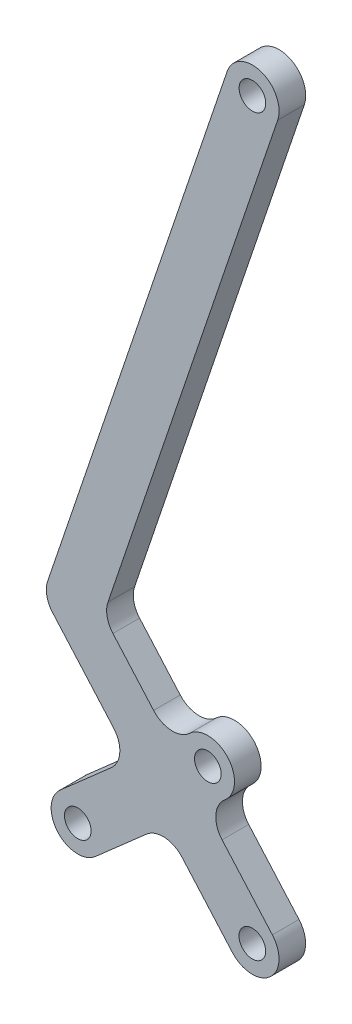
ISO-10303-21;
HEADER;
FILE_DESCRIPTION(('STEP AP214'),'2;1');
FILE_NAME('part.step','',(''),(''),'','','');
FILE_SCHEMA(('AUTOMOTIVE_DESIGN { 1 0 10303 214 1 1 1 1 }'));
ENDSEC;
DATA;
#1=APPLICATION_CONTEXT('core data for automotive mechanical design processes');
#2=APPLICATION_PROTOCOL_DEFINITION('international standard','automotive_design',2000,#1);
#3=PRODUCT_CONTEXT('',#1,'mechanical');
#4=PRODUCT('Part','Part','',(#3));
#5=PRODUCT_RELATED_PRODUCT_CATEGORY('part','',(#4));
#6=PRODUCT_DEFINITION_FORMATION('','',#4);
#7=PRODUCT_DEFINITION_CONTEXT('part definition',#1,'design');
#8=PRODUCT_DEFINITION('design','',#6,#7);
#9=PRODUCT_DEFINITION_SHAPE('','',#8);
#10=(LENGTH_UNIT() NAMED_UNIT(*) SI_UNIT(.MILLI.,.METRE.));
#11=(NAMED_UNIT(*) PLANE_ANGLE_UNIT() SI_UNIT($,.RADIAN.));
#12=(NAMED_UNIT(*) SI_UNIT($,.STERADIAN.) SOLID_ANGLE_UNIT());
#13=UNCERTAINTY_MEASURE_WITH_UNIT(LENGTH_MEASURE(1.E-05),#10,'distance_accuracy_value','');
#14=(GEOMETRIC_REPRESENTATION_CONTEXT(3) GLOBAL_UNCERTAINTY_ASSIGNED_CONTEXT((#13)) GLOBAL_UNIT_ASSIGNED_CONTEXT((#10,
#11,#12)) REPRESENTATION_CONTEXT('',''));
#15=CARTESIAN_POINT('',(0.,0.,0.));
#16=DIRECTION('',(0.,0.,1.));
#17=DIRECTION('',(1.,0.,0.));
#18=AXIS2_PLACEMENT_3D('',#15,#16,#17);
#19=CARTESIAN_POINT('',(0.,0.,12.7));
#20=DIRECTION('',(0.,0.,1.));
#21=DIRECTION('',(1.,0.,0.));
#22=AXIS2_PLACEMENT_3D('',#19,#20,#21);
#23=PLANE('',#22);
#24=CARTESIAN_POINT('',(-0.0424209515311639,-349.999997429233,12.7));
#25=DIRECTION('',(0.,0.,1.));
#26=DIRECTION('',(1.,0.,0.));
#27=AXIS2_PLACEMENT_3D('',#24,#25,#26);
#28=CIRCLE('',#27,6.34999999999992);
#29=CARTESIAN_POINT('',(6.30757904846875,-349.999997429233,12.7));
#30=VERTEX_POINT('',#29);
#31=EDGE_CURVE('E396',#30,#30,#28,.T.);
#32=ORIENTED_EDGE('',*,*,#31,.F.);
#33=EDGE_LOOP('',(#32));
#34=FACE_BOUND('',#33,.T.);
#35=CARTESIAN_POINT('',(-21.2523638635323,-287.419662485501,12.7));
#36=DIRECTION('',(0.,0.,1.));
#37=DIRECTION('',(1.,0.,0.));
#38=AXIS2_PLACEMENT_3D('',#35,#36,#37);
#39=CIRCLE('',#38,6.35);
#40=CARTESIAN_POINT('',(-14.9023638635323,-287.419662485501,12.7));
#41=VERTEX_POINT('',#40);
#42=EDGE_CURVE('E206',#41,#41,#39,.T.);
#43=ORIENTED_EDGE('',*,*,#42,.F.);
#44=EDGE_LOOP('',(#43));
#45=FACE_BOUND('',#44,.T.);
#46=CARTESIAN_POINT('',(0.,0.,12.7));
#47=DIRECTION('',(0.,0.,1.));
#48=DIRECTION('',(1.,0.,0.));
#49=AXIS2_PLACEMENT_3D('',#46,#47,#48);
#50=CIRCLE('',#49,12.7);
#51=CARTESIAN_POINT('',(12.0316476147068,-4.06564332861642,12.7));
#52=VERTEX_POINT('',#51);
#53=CARTESIAN_POINT('',(-12.0316476147067,4.06564332861641,12.7));
#54=VERTEX_POINT('',#53);
#55=EDGE_CURVE('E241',#52,#54,#50,.T.);
#56=ORIENTED_EDGE('',*,*,#55,.T.);
#57=DIRECTION('',(-0.320129395954047,-0.94737382792966,0.));
#58=VECTOR('',#57,1.);
#59=CARTESIAN_POINT('',(-12.0316476147067,4.06564332861641,12.7));
#60=LINE('',#59,#58);
#61=CARTESIAN_POINT('',(-97.6126036681888,-249.198064906118,12.7));
#62=VERTEX_POINT('',#61);
#63=EDGE_CURVE('E129',#54,#62,#60,.T.);
#64=ORIENTED_EDGE('',*,*,#63,.T.);
#65=CARTESIAN_POINT('',(-86.2441177330329,-253.039617657566,12.7));
#66=DIRECTION('',(0.,0.,1.));
#67=DIRECTION('',(1.,0.,0.));
#68=AXIS2_PLACEMENT_3D('',#65,#66,#67);
#69=CIRCLE('',#68,12.);
#70=CARTESIAN_POINT('',(-95.2552429733433,-260.964238904253,12.7));
#71=VERTEX_POINT('',#70);
#72=EDGE_CURVE('E292',#62,#71,#69,.T.);
#73=ORIENTED_EDGE('',*,*,#72,.T.);
#74=DIRECTION('',(0.660385103890572,-0.7509271033592,0.));
#75=VECTOR('',#74,1.);
#76=CARTESIAN_POINT('',(-95.2552429733433,-260.964238904253,12.7));
#77=LINE('',#76,#75);
#78=CARTESIAN_POINT('',(-66.1741985676148,-294.03243549076,12.7));
#79=VERTEX_POINT('',#78);
#80=EDGE_CURVE('E311',#71,#79,#77,.T.);
#81=ORIENTED_EDGE('',*,*,#80,.T.);
#82=CARTESIAN_POINT('',(-75.1853238079252,-301.957056737447,12.7));
#83=DIRECTION('',(0.,0.,-1.));
#84=DIRECTION('',(1.,0.,0.));
#85=AXIS2_PLACEMENT_3D('',#82,#83,#84);
#86=CIRCLE('',#85,12.);
#87=CARTESIAN_POINT('',(-67.2607025612384,-310.968181977757,12.7));
#88=VERTEX_POINT('',#87);
#89=EDGE_CURVE('E308',#79,#88,#86,.T.);
#90=ORIENTED_EDGE('',*,*,#89,.T.);
#91=DIRECTION('',(-0.750927103359199,-0.660385103890573,0.));
#92=VECTOR('',#91,1.);
#93=CARTESIAN_POINT('',(-67.2607025612384,-310.968181977757,12.7));
#94=LINE('',#93,#92);
#95=CARTESIAN_POINT('',(-91.6282870652444,-332.397678599006,12.7));
#96=VERTEX_POINT('',#95);
#97=EDGE_CURVE('E310',#88,#96,#94,.T.);
#98=ORIENTED_EDGE('',*,*,#97,.T.);
#99=CARTESIAN_POINT('',(-83.2413962458342,-341.934452811668,12.7));
#100=DIRECTION('',(0.,0.,1.));
#101=DIRECTION('',(1.,0.,0.));
#102=AXIS2_PLACEMENT_3D('',#99,#100,#101);
#103=CIRCLE('',#102,12.6999999999998);
#104=CARTESIAN_POINT('',(-74.8545054264241,-351.471227024329,12.7));
#105=VERTEX_POINT('',#104);
#106=EDGE_CURVE('E313',#96,#105,#103,.T.);
#107=ORIENTED_EDGE('',*,*,#106,.T.);
#108=DIRECTION('',(0.750927103359201,0.660385103890571,0.));
#109=VECTOR('',#108,1.);
#110=CARTESIAN_POINT('',(-50.4869209224181,-330.04173040308,12.7));
#111=LINE('',#110,#109);
#112=CARTESIAN_POINT('',(-50.4869209224181,-330.04173040308,12.7));
#113=VERTEX_POINT('',#112);
#114=EDGE_CURVE('E319',#105,#113,#111,.T.);
#115=ORIENTED_EDGE('',*,*,#114,.T.);
#116=CARTESIAN_POINT('',(-42.5622996757312,-339.052855643391,12.7));
#117=DIRECTION('',(0.,0.,-1.));
#118=DIRECTION('',(1.,0.,0.));
#119=AXIS2_PLACEMENT_3D('',#116,#117,#118);
#120=CIRCLE('',#119,12.);
#121=CARTESIAN_POINT('',(-33.5511744354208,-331.128234396704,12.7));
#122=VERTEX_POINT('',#121);
#123=EDGE_CURVE('E321',#113,#122,#120,.T.);
#124=ORIENTED_EDGE('',*,*,#123,.T.);
#125=DIRECTION('',(0.660385103890571,-0.7509271033592,0.));
#126=VECTOR('',#125,1.);
#127=CARTESIAN_POINT('',(-33.5511744354208,-331.128234396704,12.7));
#128=LINE('',#127,#126);
#129=CARTESIAN_POINT('',(-9.57919516419298,-358.386888248643,12.7));
#130=VERTEX_POINT('',#129);
#131=EDGE_CURVE('E323',#122,#130,#128,.T.);
#132=ORIENTED_EDGE('',*,*,#131,.T.);
#133=CARTESIAN_POINT('',(-0.0424209515311639,-349.999997429233,12.7));
#134=DIRECTION('',(0.,0.,1.));
#135=DIRECTION('',(1.,0.,0.));
#136=AXIS2_PLACEMENT_3D('',#133,#134,#135);
#137=CIRCLE('',#136,12.7);
#138=CARTESIAN_POINT('',(9.49435326113062,-341.613106609822,12.7));
#139=VERTEX_POINT('',#138);
#140=EDGE_CURVE('E325',#130,#139,#137,.T.);
#141=ORIENTED_EDGE('',*,*,#140,.T.);
#142=DIRECTION('',(-0.660385103890569,0.750927103359202,0.));
#143=VECTOR('',#142,1.);
#144=CARTESIAN_POINT('',(9.4943532611306,-341.613106609822,12.7));
#145=LINE('',#144,#143);
#146=CARTESIAN_POINT('',(-14.477626010097,-314.354452757884,12.7));
#147=VERTEX_POINT('',#146);
#148=EDGE_CURVE('E327',#139,#147,#145,.T.);
#149=ORIENTED_EDGE('',*,*,#148,.T.);
#150=CARTESIAN_POINT('',(-5.46650076978666,-306.429831511197,12.7));
#151=DIRECTION('',(0.,0.,-1.));
#152=DIRECTION('',(-1.,0.,0.));
#153=AXIS2_PLACEMENT_3D('',#150,#151,#152);
#154=CIRCLE('',#153,11.9999999999999);
#155=CARTESIAN_POINT('',(-13.3911220164734,-297.418706270886,12.7));
#156=VERTEX_POINT('',#155);
#157=EDGE_CURVE('E329',#147,#156,#154,.T.);
#158=ORIENTED_EDGE('',*,*,#157,.T.);
#159=DIRECTION('',(0.750927103359165,0.660385103890611,0.));
#160=VECTOR('',#159,1.);
#161=CARTESIAN_POINT('',(-13.3911220164734,-297.418706270886,12.7));
#162=LINE('',#161,#160);
#163=CARTESIAN_POINT('',(-12.8654730441222,-296.956436698163,12.7));
#164=VERTEX_POINT('',#163);
#165=EDGE_CURVE('E331',#156,#164,#162,.T.);
#166=ORIENTED_EDGE('',*,*,#165,.T.);
#167=CARTESIAN_POINT('',(-21.2523638635323,-287.419662485501,12.7));
#168=DIRECTION('',(0.,0.,1.));
#169=DIRECTION('',(-1.,0.,0.));
#170=AXIS2_PLACEMENT_3D('',#167,#168,#169);
#171=CIRCLE('',#170,12.7);
#172=CARTESIAN_POINT('',(-29.6392546829426,-277.882888272839,12.7));
#173=VERTEX_POINT('',#172);
#174=EDGE_CURVE('E333',#164,#173,#171,.T.);
#175=ORIENTED_EDGE('',*,*,#174,.T.);
#176=DIRECTION('',(-0.75092710335927,-0.660385103890492,0.));
#177=VECTOR('',#176,1.);
#178=CARTESIAN_POINT('',(-30.164903655294,-278.345157845563,12.7));
#179=LINE('',#178,#177);
#180=CARTESIAN_POINT('',(-30.164903655294,-278.345157845563,12.7));
#181=VERTEX_POINT('',#180);
#182=EDGE_CURVE('E335',#173,#181,#179,.T.);
#183=ORIENTED_EDGE('',*,*,#182,.T.);
#184=CARTESIAN_POINT('',(-38.0895249019807,-269.334032605252,12.7));
#185=DIRECTION('',(0.,0.,-1.));
#186=DIRECTION('',(-1.,0.,0.));
#187=AXIS2_PLACEMENT_3D('',#184,#185,#186);
#188=CIRCLE('',#187,11.9999999999999);
#189=CARTESIAN_POINT('',(-47.1006501422912,-277.258653851939,12.7));
#190=VERTEX_POINT('',#189);
#191=EDGE_CURVE('E184',#181,#190,#188,.T.);
#192=ORIENTED_EDGE('',*,*,#191,.T.);
#193=DIRECTION('',(-0.660385103890571,0.750927103359201,0.));
#194=VECTOR('',#193,1.);
#195=CARTESIAN_POINT('',(-47.1006501422913,-277.258653851939,12.7));
#196=LINE('',#195,#194);
#197=CARTESIAN_POINT('',(-66.4973472035185,-255.202575583195,12.7));
#198=VERTEX_POINT('',#197);
#199=EDGE_CURVE('E178',#190,#198,#196,.T.);
#200=ORIENTED_EDGE('',*,*,#199,.T.);
#201=CARTESIAN_POINT('',(-57.4862219632082,-247.277954336508,12.7));
#202=DIRECTION('',(0.,0.,-1.));
#203=DIRECTION('',(-1.,0.,0.));
#204=AXIS2_PLACEMENT_3D('',#201,#202,#203);
#205=CIRCLE('',#204,12.);
#206=CARTESIAN_POINT('',(-68.8547078983641,-243.436401585059,12.7));
#207=VERTEX_POINT('',#206);
#208=EDGE_CURVE('E182',#198,#207,#205,.T.);
#209=ORIENTED_EDGE('',*,*,#208,.T.);
#210=DIRECTION('',(0.320129395954047,0.94737382792966,0.));
#211=VECTOR('',#210,1.);
#212=CARTESIAN_POINT('',(-68.8547078983641,-243.436401585059,12.7));
#213=LINE('',#212,#211);
#214=EDGE_CURVE('E50',#207,#52,#213,.T.);
#215=ORIENTED_EDGE('',*,*,#214,.T.);
#216=EDGE_LOOP('',(#56,#64,#73,#81,#90,#98,#107,#115,#124,#132,#141,#149,#158,#166,#175,#183,
#192,#200,#209,#215));
#217=FACE_BOUND('',#216,.T.);
#218=CARTESIAN_POINT('',(-83.2413962458342,-341.934452811668,12.7));
#219=DIRECTION('',(0.,0.,1.));
#220=DIRECTION('',(1.,0.,0.));
#221=AXIS2_PLACEMENT_3D('',#218,#219,#220);
#222=CIRCLE('',#221,6.34999999999999);
#223=CARTESIAN_POINT('',(-76.8913962458342,-341.934452811668,12.7));
#224=VERTEX_POINT('',#223);
#225=EDGE_CURVE('E402',#224,#224,#222,.T.);
#226=ORIENTED_EDGE('',*,*,#225,.F.);
#227=EDGE_LOOP('',(#226));
#228=FACE_BOUND('',#227,.T.);
#229=CARTESIAN_POINT('',(0.,0.,12.7));
#230=DIRECTION('',(0.,0.,1.));
#231=DIRECTION('',(1.,0.,0.));
#232=AXIS2_PLACEMENT_3D('',#229,#230,#231);
#233=CIRCLE('',#232,6.35);
#234=CARTESIAN_POINT('',(6.35000000000003,0.,12.7));
#235=VERTEX_POINT('',#234);
#236=EDGE_CURVE('E387',#235,#235,#233,.T.);
#237=ORIENTED_EDGE('',*,*,#236,.F.);
#238=EDGE_LOOP('',(#237));
#239=FACE_BOUND('',#238,.T.);
#240=ADVANCED_FACE('F33',(#34,#45,#217,#228,#239),#23,.T.);
#241=CARTESIAN_POINT('',(0.,0.,0.));
#242=DIRECTION('',(0.,0.,1.));
#243=DIRECTION('',(1.,0.,0.));
#244=AXIS2_PLACEMENT_3D('',#241,#242,#243);
#245=PLANE('',#244);
#246=CARTESIAN_POINT('',(-0.0424209515311639,-349.999997429233,0.));
#247=DIRECTION('',(0.,0.,1.));
#248=DIRECTION('',(1.,0.,0.));
#249=AXIS2_PLACEMENT_3D('',#246,#247,#248);
#250=CIRCLE('',#249,6.34999999999992);
#251=CARTESIAN_POINT('',(6.30757904846875,-349.999997429233,0.));
#252=VERTEX_POINT('',#251);
#253=EDGE_CURVE('E393',#252,#252,#250,.T.);
#254=ORIENTED_EDGE('',*,*,#253,.T.);
#255=EDGE_LOOP('',(#254));
#256=FACE_BOUND('',#255,.T.);
#257=CARTESIAN_POINT('',(-21.2523638635323,-287.419662485501,0.));
#258=DIRECTION('',(0.,0.,1.));
#259=DIRECTION('',(1.,0.,0.));
#260=AXIS2_PLACEMENT_3D('',#257,#258,#259);
#261=CIRCLE('',#260,6.35);
#262=CARTESIAN_POINT('',(-14.9023638635323,-287.419662485501,0.));
#263=VERTEX_POINT('',#262);
#264=EDGE_CURVE('E405',#263,#263,#261,.T.);
#265=ORIENTED_EDGE('',*,*,#264,.T.);
#266=EDGE_LOOP('',(#265));
#267=FACE_BOUND('',#266,.T.);
#268=CARTESIAN_POINT('',(0.,0.,0.));
#269=DIRECTION('',(0.,0.,1.));
#270=DIRECTION('',(1.,0.,0.));
#271=AXIS2_PLACEMENT_3D('',#268,#269,#270);
#272=CIRCLE('',#271,12.7);
#273=CARTESIAN_POINT('',(12.0316476147068,-4.06564332861642,0.));
#274=VERTEX_POINT('',#273);
#275=CARTESIAN_POINT('',(-12.0316476147067,4.06564332861641,0.));
#276=VERTEX_POINT('',#275);
#277=EDGE_CURVE('E202',#274,#276,#272,.T.);
#278=ORIENTED_EDGE('',*,*,#277,.F.);
#279=DIRECTION('',(0.320129395954047,0.94737382792966,0.));
#280=VECTOR('',#279,1.);
#281=CARTESIAN_POINT('',(-68.8547078983641,-243.436401585059,0.));
#282=LINE('',#281,#280);
#283=CARTESIAN_POINT('',(-68.8547078983641,-243.436401585059,0.));
#284=VERTEX_POINT('',#283);
#285=EDGE_CURVE('E121',#284,#274,#282,.T.);
#286=ORIENTED_EDGE('',*,*,#285,.F.);
#287=CARTESIAN_POINT('',(-57.4862219632082,-247.277954336508,0.));
#288=DIRECTION('',(0.,0.,-1.));
#289=DIRECTION('',(-1.,0.,0.));
#290=AXIS2_PLACEMENT_3D('',#287,#288,#289);
#291=CIRCLE('',#290,12.);
#292=CARTESIAN_POINT('',(-66.4973472035185,-255.202575583195,0.));
#293=VERTEX_POINT('',#292);
#294=EDGE_CURVE('E115',#293,#284,#291,.T.);
#295=ORIENTED_EDGE('',*,*,#294,.F.);
#296=DIRECTION('',(-0.660385103890571,0.750927103359201,0.));
#297=VECTOR('',#296,1.);
#298=CARTESIAN_POINT('',(-47.1006501422913,-277.258653851939,0.));
#299=LINE('',#298,#297);
#300=CARTESIAN_POINT('',(-47.1006501422912,-277.258653851939,0.));
#301=VERTEX_POINT('',#300);
#302=EDGE_CURVE('E192',#301,#293,#299,.T.);
#303=ORIENTED_EDGE('',*,*,#302,.F.);
#304=CARTESIAN_POINT('',(-38.0895249019807,-269.334032605252,0.));
#305=DIRECTION('',(0.,0.,-1.));
#306=DIRECTION('',(-1.,0.,0.));
#307=AXIS2_PLACEMENT_3D('',#304,#305,#306);
#308=CIRCLE('',#307,11.9999999999999);
#309=CARTESIAN_POINT('',(-30.164903655294,-278.345157845563,0.));
#310=VERTEX_POINT('',#309);
#311=EDGE_CURVE('E236',#310,#301,#308,.T.);
#312=ORIENTED_EDGE('',*,*,#311,.F.);
#313=DIRECTION('',(-0.75092710335927,-0.660385103890492,0.));
#314=VECTOR('',#313,1.);
#315=CARTESIAN_POINT('',(-30.164903655294,-278.345157845563,0.));
#316=LINE('',#315,#314);
#317=CARTESIAN_POINT('',(-29.6392546829426,-277.882888272839,0.));
#318=VERTEX_POINT('',#317);
#319=EDGE_CURVE('E234',#318,#310,#316,.T.);
#320=ORIENTED_EDGE('',*,*,#319,.F.);
#321=CARTESIAN_POINT('',(-21.2523638635323,-287.419662485501,0.));
#322=DIRECTION('',(0.,0.,1.));
#323=DIRECTION('',(-1.,0.,0.));
#324=AXIS2_PLACEMENT_3D('',#321,#322,#323);
#325=CIRCLE('',#324,12.7);
#326=CARTESIAN_POINT('',(-12.8654730441222,-296.956436698163,0.));
#327=VERTEX_POINT('',#326);
#328=EDGE_CURVE('E232',#327,#318,#325,.T.);
#329=ORIENTED_EDGE('',*,*,#328,.F.);
#330=DIRECTION('',(0.750927103359165,0.660385103890611,0.));
#331=VECTOR('',#330,1.);
#332=CARTESIAN_POINT('',(-13.3911220164734,-297.418706270886,0.));
#333=LINE('',#332,#331);
#334=CARTESIAN_POINT('',(-13.3911220164734,-297.418706270886,0.));
#335=VERTEX_POINT('',#334);
#336=EDGE_CURVE('E230',#335,#327,#333,.T.);
#337=ORIENTED_EDGE('',*,*,#336,.F.);
#338=CARTESIAN_POINT('',(-5.46650076978666,-306.429831511197,0.));
#339=DIRECTION('',(0.,0.,-1.));
#340=DIRECTION('',(-1.,0.,0.));
#341=AXIS2_PLACEMENT_3D('',#338,#339,#340);
#342=CIRCLE('',#341,11.9999999999999);
#343=CARTESIAN_POINT('',(-14.477626010097,-314.354452757884,0.));
#344=VERTEX_POINT('',#343);
#345=EDGE_CURVE('E228',#344,#335,#342,.T.);
#346=ORIENTED_EDGE('',*,*,#345,.F.);
#347=DIRECTION('',(-0.660385103890569,0.750927103359202,0.));
#348=VECTOR('',#347,1.);
#349=CARTESIAN_POINT('',(9.4943532611306,-341.613106609822,0.));
#350=LINE('',#349,#348);
#351=CARTESIAN_POINT('',(9.49435326113062,-341.613106609822,0.));
#352=VERTEX_POINT('',#351);
#353=EDGE_CURVE('E226',#352,#344,#350,.T.);
#354=ORIENTED_EDGE('',*,*,#353,.F.);
#355=CARTESIAN_POINT('',(-0.0424209515311639,-349.999997429233,0.));
#356=DIRECTION('',(0.,0.,1.));
#357=DIRECTION('',(1.,0.,0.));
#358=AXIS2_PLACEMENT_3D('',#355,#356,#357);
#359=CIRCLE('',#358,12.7);
#360=CARTESIAN_POINT('',(-9.57919516419298,-358.386888248643,0.));
#361=VERTEX_POINT('',#360);
#362=EDGE_CURVE('E224',#361,#352,#359,.T.);
#363=ORIENTED_EDGE('',*,*,#362,.F.);
#364=DIRECTION('',(0.660385103890571,-0.7509271033592,0.));
#365=VECTOR('',#364,1.);
#366=CARTESIAN_POINT('',(-33.5511744354208,-331.128234396704,0.));
#367=LINE('',#366,#365);
#368=CARTESIAN_POINT('',(-33.5511744354208,-331.128234396704,0.));
#369=VERTEX_POINT('',#368);
#370=EDGE_CURVE('E222',#369,#361,#367,.T.);
#371=ORIENTED_EDGE('',*,*,#370,.F.);
#372=CARTESIAN_POINT('',(-42.5622996757312,-339.052855643391,0.));
#373=DIRECTION('',(0.,0.,-1.));
#374=DIRECTION('',(1.,0.,0.));
#375=AXIS2_PLACEMENT_3D('',#372,#373,#374);
#376=CIRCLE('',#375,12.);
#377=CARTESIAN_POINT('',(-50.4869209224181,-330.04173040308,0.));
#378=VERTEX_POINT('',#377);
#379=EDGE_CURVE('E220',#378,#369,#376,.T.);
#380=ORIENTED_EDGE('',*,*,#379,.F.);
#381=DIRECTION('',(0.750927103359201,0.660385103890571,0.));
#382=VECTOR('',#381,1.);
#383=CARTESIAN_POINT('',(-50.4869209224181,-330.04173040308,0.));
#384=LINE('',#383,#382);
#385=CARTESIAN_POINT('',(-74.8545054264241,-351.471227024329,0.));
#386=VERTEX_POINT('',#385);
#387=EDGE_CURVE('E218',#386,#378,#384,.T.);
#388=ORIENTED_EDGE('',*,*,#387,.F.);
#389=CARTESIAN_POINT('',(-83.2413962458342,-341.934452811668,0.));
#390=DIRECTION('',(0.,0.,1.));
#391=DIRECTION('',(1.,0.,0.));
#392=AXIS2_PLACEMENT_3D('',#389,#390,#391);
#393=CIRCLE('',#392,12.6999999999998);
#394=CARTESIAN_POINT('',(-91.6282870652444,-332.397678599006,0.));
#395=VERTEX_POINT('',#394);
#396=EDGE_CURVE('E216',#395,#386,#393,.T.);
#397=ORIENTED_EDGE('',*,*,#396,.F.);
#398=DIRECTION('',(-0.750927103359199,-0.660385103890573,0.));
#399=VECTOR('',#398,1.);
#400=CARTESIAN_POINT('',(-67.2607025612384,-310.968181977757,0.));
#401=LINE('',#400,#399);
#402=CARTESIAN_POINT('',(-67.2607025612384,-310.968181977757,0.));
#403=VERTEX_POINT('',#402);
#404=EDGE_CURVE('E214',#403,#395,#401,.T.);
#405=ORIENTED_EDGE('',*,*,#404,.F.);
#406=CARTESIAN_POINT('',(-75.1853238079252,-301.957056737447,0.));
#407=DIRECTION('',(0.,0.,-1.));
#408=DIRECTION('',(1.,0.,0.));
#409=AXIS2_PLACEMENT_3D('',#406,#407,#408);
#410=CIRCLE('',#409,12.);
#411=CARTESIAN_POINT('',(-66.1741985676148,-294.03243549076,0.));
#412=VERTEX_POINT('',#411);
#413=EDGE_CURVE('E212',#412,#403,#410,.T.);
#414=ORIENTED_EDGE('',*,*,#413,.F.);
#415=DIRECTION('',(0.660385103890572,-0.7509271033592,0.));
#416=VECTOR('',#415,1.);
#417=CARTESIAN_POINT('',(-95.2552429733433,-260.964238904253,0.));
#418=LINE('',#417,#416);
#419=CARTESIAN_POINT('',(-95.2552429733433,-260.964238904253,0.));
#420=VERTEX_POINT('',#419);
#421=EDGE_CURVE('E210',#420,#412,#418,.T.);
#422=ORIENTED_EDGE('',*,*,#421,.F.);
#423=CARTESIAN_POINT('',(-86.2441177330329,-253.039617657566,0.));
#424=DIRECTION('',(0.,0.,1.));
#425=DIRECTION('',(1.,0.,0.));
#426=AXIS2_PLACEMENT_3D('',#423,#424,#425);
#427=CIRCLE('',#426,12.);
#428=CARTESIAN_POINT('',(-97.6126036681888,-249.198064906118,0.));
#429=VERTEX_POINT('',#428);
#430=EDGE_CURVE('E208',#429,#420,#427,.T.);
#431=ORIENTED_EDGE('',*,*,#430,.F.);
#432=DIRECTION('',(-0.320129395954047,-0.94737382792966,0.));
#433=VECTOR('',#432,1.);
#434=CARTESIAN_POINT('',(-12.0316476147067,4.06564332861641,0.));
#435=LINE('',#434,#433);
#436=EDGE_CURVE('E205',#276,#429,#435,.T.);
#437=ORIENTED_EDGE('',*,*,#436,.F.);
#438=EDGE_LOOP('',(#278,#286,#295,#303,#312,#320,#329,#337,#346,#354,#363,#371,#380,#388,#397,
#405,#414,#422,#431,#437));
#439=FACE_BOUND('',#438,.T.);
#440=CARTESIAN_POINT('',(-83.2413962458342,-341.934452811668,0.));
#441=DIRECTION('',(0.,0.,1.));
#442=DIRECTION('',(1.,0.,0.));
#443=AXIS2_PLACEMENT_3D('',#440,#441,#442);
#444=CIRCLE('',#443,6.34999999999999);
#445=CARTESIAN_POINT('',(-76.8913962458342,-341.934452811668,0.));
#446=VERTEX_POINT('',#445);
#447=EDGE_CURVE('E399',#446,#446,#444,.T.);
#448=ORIENTED_EDGE('',*,*,#447,.T.);
#449=EDGE_LOOP('',(#448));
#450=FACE_BOUND('',#449,.T.);
#451=CARTESIAN_POINT('',(0.,0.,0.));
#452=DIRECTION('',(0.,0.,1.));
#453=DIRECTION('',(1.,0.,0.));
#454=AXIS2_PLACEMENT_3D('',#451,#452,#453);
#455=CIRCLE('',#454,6.35);
#456=CARTESIAN_POINT('',(6.35000000000003,0.,0.));
#457=VERTEX_POINT('',#456);
#458=EDGE_CURVE('E390',#457,#457,#455,.T.);
#459=ORIENTED_EDGE('',*,*,#458,.T.);
#460=EDGE_LOOP('',(#459));
#461=FACE_BOUND('',#460,.T.);
#462=ADVANCED_FACE('F296',(#256,#267,#439,#450,#461),#245,.F.);
#463=CARTESIAN_POINT('',(0.,0.,12.7));
#464=DIRECTION('',(0.,0.,-1.));
#465=DIRECTION('',(-1.,0.,0.));
#466=AXIS2_PLACEMENT_3D('',#463,#464,#465);
#467=CYLINDRICAL_SURFACE('',#466,12.7);
#468=ORIENTED_EDGE('',*,*,#277,.T.);
#469=DIRECTION('',(0.,0.,-1.));
#470=VECTOR('',#469,1.);
#471=CARTESIAN_POINT('',(-12.0316476147067,4.06564332861641,12.7));
#472=LINE('',#471,#470);
#473=EDGE_CURVE('E11',#54,#276,#472,.T.);
#474=ORIENTED_EDGE('',*,*,#473,.F.);
#475=ORIENTED_EDGE('',*,*,#55,.F.);
#476=DIRECTION('',(0.,0.,-1.));
#477=VECTOR('',#476,1.);
#478=CARTESIAN_POINT('',(12.0316476147068,-4.06564332861642,12.7));
#479=LINE('',#478,#477);
#480=EDGE_CURVE('E198',#52,#274,#479,.T.);
#481=ORIENTED_EDGE('',*,*,#480,.T.);
#482=EDGE_LOOP('',(#468,#474,#475,#481));
#483=FACE_BOUND('',#482,.T.);
#484=ADVANCED_FACE('F35',(#483),#467,.T.);
#485=CARTESIAN_POINT('',(-12.0316476147067,4.06564332861641,12.7));
#486=DIRECTION('',(0.94737382792966,-0.320129395954047,0.));
#487=DIRECTION('',(0.320129395954047,0.94737382792966,0.));
#488=AXIS2_PLACEMENT_3D('',#485,#486,#487);
#489=PLANE('',#488);
#490=ORIENTED_EDGE('',*,*,#436,.T.);
#491=DIRECTION('',(0.,0.,-1.));
#492=VECTOR('',#491,1.);
#493=CARTESIAN_POINT('',(-97.6126036681888,-249.198064906118,12.7));
#494=LINE('',#493,#492);
#495=EDGE_CURVE('E42',#62,#429,#494,.T.);
#496=ORIENTED_EDGE('',*,*,#495,.F.);
#497=ORIENTED_EDGE('',*,*,#63,.F.);
#498=ORIENTED_EDGE('',*,*,#473,.T.);
#499=EDGE_LOOP('',(#490,#496,#497,#498));
#500=FACE_BOUND('',#499,.T.);
#501=ADVANCED_FACE('F594',(#500),#489,.F.);
#502=CARTESIAN_POINT('',(-86.2441177330329,-253.039617657566,12.7));
#503=DIRECTION('',(0.,0.,-1.));
#504=DIRECTION('',(-1.,0.,0.));
#505=AXIS2_PLACEMENT_3D('',#502,#503,#504);
#506=CYLINDRICAL_SURFACE('',#505,12.);
#507=ORIENTED_EDGE('',*,*,#430,.T.);
#508=DIRECTION('',(0.,0.,-1.));
#509=VECTOR('',#508,1.);
#510=CARTESIAN_POINT('',(-95.2552429733433,-260.964238904253,12.7));
#511=LINE('',#510,#509);
#512=EDGE_CURVE('E284',#71,#420,#511,.T.);
#513=ORIENTED_EDGE('',*,*,#512,.F.);
#514=ORIENTED_EDGE('',*,*,#72,.F.);
#515=ORIENTED_EDGE('',*,*,#495,.T.);
#516=EDGE_LOOP('',(#507,#513,#514,#515));
#517=FACE_BOUND('',#516,.T.);
#518=ADVANCED_FACE('F290',(#517),#506,.T.);
#519=CARTESIAN_POINT('',(-95.2552429733433,-260.964238904253,12.7));
#520=DIRECTION('',(0.7509271033592,0.660385103890572,0.));
#521=DIRECTION('',(-0.660385103890572,0.7509271033592,0.));
#522=AXIS2_PLACEMENT_3D('',#519,#520,#521);
#523=PLANE('',#522);
#524=ORIENTED_EDGE('',*,*,#421,.T.);
#525=DIRECTION('',(0.,0.,-1.));
#526=VECTOR('',#525,1.);
#527=CARTESIAN_POINT('',(-66.1741985676148,-294.03243549076,12.7));
#528=LINE('',#527,#526);
#529=EDGE_CURVE('E281',#79,#412,#528,.T.);
#530=ORIENTED_EDGE('',*,*,#529,.F.);
#531=ORIENTED_EDGE('',*,*,#80,.F.);
#532=ORIENTED_EDGE('',*,*,#512,.T.);
#533=EDGE_LOOP('',(#524,#530,#531,#532));
#534=FACE_BOUND('',#533,.T.);
#535=ADVANCED_FACE('F302',(#534),#523,.F.);
#536=CARTESIAN_POINT('',(-75.1853238079252,-301.957056737447,12.7));
#537=DIRECTION('',(0.,0.,-1.));
#538=DIRECTION('',(-1.,0.,0.));
#539=AXIS2_PLACEMENT_3D('',#536,#537,#538);
#540=CYLINDRICAL_SURFACE('',#539,12.);
#541=ORIENTED_EDGE('',*,*,#413,.T.);
#542=DIRECTION('',(0.,0.,-1.));
#543=VECTOR('',#542,1.);
#544=CARTESIAN_POINT('',(-67.2607025612384,-310.968181977757,12.7));
#545=LINE('',#544,#543);
#546=EDGE_CURVE('E278',#88,#403,#545,.T.);
#547=ORIENTED_EDGE('',*,*,#546,.F.);
#548=ORIENTED_EDGE('',*,*,#89,.F.);
#549=ORIENTED_EDGE('',*,*,#529,.T.);
#550=EDGE_LOOP('',(#541,#547,#548,#549));
#551=FACE_BOUND('',#550,.T.);
#552=ADVANCED_FACE('F306',(#551),#540,.F.);
#553=CARTESIAN_POINT('',(-67.2607025612384,-310.968181977757,12.7));
#554=DIRECTION('',(0.660385103890573,-0.750927103359199,0.));
#555=DIRECTION('',(0.750927103359199,0.660385103890573,0.));
#556=AXIS2_PLACEMENT_3D('',#553,#554,#555);
#557=PLANE('',#556);
#558=ORIENTED_EDGE('',*,*,#404,.T.);
#559=DIRECTION('',(0.,0.,-1.));
#560=VECTOR('',#559,1.);
#561=CARTESIAN_POINT('',(-91.6282870652444,-332.397678599006,12.7));
#562=LINE('',#561,#560);
#563=EDGE_CURVE('E275',#96,#395,#562,.T.);
#564=ORIENTED_EDGE('',*,*,#563,.F.);
#565=ORIENTED_EDGE('',*,*,#97,.F.);
#566=ORIENTED_EDGE('',*,*,#546,.T.);
#567=EDGE_LOOP('',(#558,#564,#565,#566));
#568=FACE_BOUND('',#567,.T.);
#569=ADVANCED_FACE('F559',(#568),#557,.F.);
#570=CARTESIAN_POINT('',(-83.2413962458342,-341.934452811668,12.7));
#571=DIRECTION('',(0.,0.,-1.));
#572=DIRECTION('',(-1.,0.,0.));
#573=AXIS2_PLACEMENT_3D('',#570,#571,#572);
#574=CYLINDRICAL_SURFACE('',#573,12.6999999999998);
#575=ORIENTED_EDGE('',*,*,#396,.T.);
#576=DIRECTION('',(0.,0.,-1.));
#577=VECTOR('',#576,1.);
#578=CARTESIAN_POINT('',(-74.8545054264241,-351.471227024329,12.7));
#579=LINE('',#578,#577);
#580=EDGE_CURVE('E272',#105,#386,#579,.T.);
#581=ORIENTED_EDGE('',*,*,#580,.F.);
#582=ORIENTED_EDGE('',*,*,#106,.F.);
#583=ORIENTED_EDGE('',*,*,#563,.T.);
#584=EDGE_LOOP('',(#575,#581,#582,#583));
#585=FACE_BOUND('',#584,.T.);
#586=ADVANCED_FACE('F549',(#585),#574,.T.);
#587=CARTESIAN_POINT('',(-50.4869209224181,-330.04173040308,12.7));
#588=DIRECTION('',(-0.660385103890571,0.750927103359201,0.));
#589=DIRECTION('',(-0.750927103359201,-0.660385103890571,0.));
#590=AXIS2_PLACEMENT_3D('',#587,#588,#589);
#591=PLANE('',#590);
#592=ORIENTED_EDGE('',*,*,#387,.T.);
#593=DIRECTION('',(0.,0.,-1.));
#594=VECTOR('',#593,1.);
#595=CARTESIAN_POINT('',(-50.4869209224181,-330.04173040308,12.7));
#596=LINE('',#595,#594);
#597=EDGE_CURVE('E269',#113,#378,#596,.T.);
#598=ORIENTED_EDGE('',*,*,#597,.F.);
#599=ORIENTED_EDGE('',*,*,#114,.F.);
#600=ORIENTED_EDGE('',*,*,#580,.T.);
#601=EDGE_LOOP('',(#592,#598,#599,#600));
#602=FACE_BOUND('',#601,.T.);
#603=ADVANCED_FACE('F539',(#602),#591,.F.);
#604=CARTESIAN_POINT('',(-42.5622996757312,-339.052855643391,12.7));
#605=DIRECTION('',(0.,0.,-1.));
#606=DIRECTION('',(-1.,0.,0.));
#607=AXIS2_PLACEMENT_3D('',#604,#605,#606);
#608=CYLINDRICAL_SURFACE('',#607,12.);
#609=ORIENTED_EDGE('',*,*,#379,.T.);
#610=DIRECTION('',(0.,0.,-1.));
#611=VECTOR('',#610,1.);
#612=CARTESIAN_POINT('',(-33.5511744354208,-331.128234396704,12.7));
#613=LINE('',#612,#611);
#614=EDGE_CURVE('E266',#122,#369,#613,.T.);
#615=ORIENTED_EDGE('',*,*,#614,.F.);
#616=ORIENTED_EDGE('',*,*,#123,.F.);
#617=ORIENTED_EDGE('',*,*,#597,.T.);
#618=EDGE_LOOP('',(#609,#615,#616,#617));
#619=FACE_BOUND('',#618,.T.);
#620=ADVANCED_FACE('F529',(#619),#608,.F.);
#621=CARTESIAN_POINT('',(-33.5511744354208,-331.128234396704,12.7));
#622=DIRECTION('',(0.7509271033592,0.660385103890571,0.));
#623=DIRECTION('',(-0.660385103890571,0.750927103359201,0.));
#624=AXIS2_PLACEMENT_3D('',#621,#622,#623);
#625=PLANE('',#624);
#626=ORIENTED_EDGE('',*,*,#370,.T.);
#627=DIRECTION('',(0.,0.,-1.));
#628=VECTOR('',#627,1.);
#629=CARTESIAN_POINT('',(-9.57919516419298,-358.386888248643,12.7));
#630=LINE('',#629,#628);
#631=EDGE_CURVE('E263',#130,#361,#630,.T.);
#632=ORIENTED_EDGE('',*,*,#631,.F.);
#633=ORIENTED_EDGE('',*,*,#131,.F.);
#634=ORIENTED_EDGE('',*,*,#614,.T.);
#635=EDGE_LOOP('',(#626,#632,#633,#634));
#636=FACE_BOUND('',#635,.T.);
#637=ADVANCED_FACE('F519',(#636),#625,.F.);
#638=CARTESIAN_POINT('',(-0.0424209515311639,-349.999997429233,12.7));
#639=DIRECTION('',(0.,0.,-1.));
#640=DIRECTION('',(-1.,0.,0.));
#641=AXIS2_PLACEMENT_3D('',#638,#639,#640);
#642=CYLINDRICAL_SURFACE('',#641,12.7);
#643=ORIENTED_EDGE('',*,*,#362,.T.);
#644=DIRECTION('',(0.,0.,-1.));
#645=VECTOR('',#644,1.);
#646=CARTESIAN_POINT('',(9.49435326113062,-341.613106609822,12.7));
#647=LINE('',#646,#645);
#648=EDGE_CURVE('E260',#139,#352,#647,.T.);
#649=ORIENTED_EDGE('',*,*,#648,.F.);
#650=ORIENTED_EDGE('',*,*,#140,.F.);
#651=ORIENTED_EDGE('',*,*,#631,.T.);
#652=EDGE_LOOP('',(#643,#649,#650,#651));
#653=FACE_BOUND('',#652,.T.);
#654=ADVANCED_FACE('F509',(#653),#642,.T.);
#655=CARTESIAN_POINT('',(9.4943532611306,-341.613106609822,12.7));
#656=DIRECTION('',(-0.750927103359202,-0.660385103890569,0.));
#657=DIRECTION('',(0.660385103890569,-0.750927103359202,0.));
#658=AXIS2_PLACEMENT_3D('',#655,#656,#657);
#659=PLANE('',#658);
#660=ORIENTED_EDGE('',*,*,#353,.T.);
#661=DIRECTION('',(0.,0.,-1.));
#662=VECTOR('',#661,1.);
#663=CARTESIAN_POINT('',(-14.477626010097,-314.354452757884,12.7));
#664=LINE('',#663,#662);
#665=EDGE_CURVE('E257',#147,#344,#664,.T.);
#666=ORIENTED_EDGE('',*,*,#665,.F.);
#667=ORIENTED_EDGE('',*,*,#148,.F.);
#668=ORIENTED_EDGE('',*,*,#648,.T.);
#669=EDGE_LOOP('',(#660,#666,#667,#668));
#670=FACE_BOUND('',#669,.T.);
#671=ADVANCED_FACE('F499',(#670),#659,.F.);
#672=CARTESIAN_POINT('',(-5.46650076978666,-306.429831511197,12.7));
#673=DIRECTION('',(0.,0.,-1.));
#674=DIRECTION('',(-1.,0.,0.));
#675=AXIS2_PLACEMENT_3D('',#672,#673,#674);
#676=CYLINDRICAL_SURFACE('',#675,11.9999999999999);
#677=ORIENTED_EDGE('',*,*,#345,.T.);
#678=DIRECTION('',(0.,0.,-1.));
#679=VECTOR('',#678,1.);
#680=CARTESIAN_POINT('',(-13.3911220164734,-297.418706270886,12.7));
#681=LINE('',#680,#679);
#682=EDGE_CURVE('E254',#156,#335,#681,.T.);
#683=ORIENTED_EDGE('',*,*,#682,.F.);
#684=ORIENTED_EDGE('',*,*,#157,.F.);
#685=ORIENTED_EDGE('',*,*,#665,.T.);
#686=EDGE_LOOP('',(#677,#683,#684,#685));
#687=FACE_BOUND('',#686,.T.);
#688=ADVANCED_FACE('F489',(#687),#676,.F.);
#689=CARTESIAN_POINT('',(-13.3911220164734,-297.418706270886,12.7));
#690=DIRECTION('',(-0.660385103890611,0.750927103359165,0.));
#691=DIRECTION('',(-0.750927103359165,-0.660385103890611,0.));
#692=AXIS2_PLACEMENT_3D('',#689,#690,#691);
#693=PLANE('',#692);
#694=ORIENTED_EDGE('',*,*,#336,.T.);
#695=DIRECTION('',(0.,0.,-1.));
#696=VECTOR('',#695,1.);
#697=CARTESIAN_POINT('',(-12.8654730441222,-296.956436698163,12.7));
#698=LINE('',#697,#696);
#699=EDGE_CURVE('E251',#164,#327,#698,.T.);
#700=ORIENTED_EDGE('',*,*,#699,.F.);
#701=ORIENTED_EDGE('',*,*,#165,.F.);
#702=ORIENTED_EDGE('',*,*,#682,.T.);
#703=EDGE_LOOP('',(#694,#700,#701,#702));
#704=FACE_BOUND('',#703,.T.);
#705=ADVANCED_FACE('F479',(#704),#693,.F.);
#706=CARTESIAN_POINT('',(-21.2523638635323,-287.419662485501,12.7));
#707=DIRECTION('',(0.,0.,-1.));
#708=DIRECTION('',(-1.,0.,0.));
#709=AXIS2_PLACEMENT_3D('',#706,#707,#708);
#710=CYLINDRICAL_SURFACE('',#709,12.7);
#711=ORIENTED_EDGE('',*,*,#328,.T.);
#712=DIRECTION('',(0.,0.,-1.));
#713=VECTOR('',#712,1.);
#714=CARTESIAN_POINT('',(-29.6392546829426,-277.882888272839,12.7));
#715=LINE('',#714,#713);
#716=EDGE_CURVE('E248',#173,#318,#715,.T.);
#717=ORIENTED_EDGE('',*,*,#716,.F.);
#718=ORIENTED_EDGE('',*,*,#174,.F.);
#719=ORIENTED_EDGE('',*,*,#699,.T.);
#720=EDGE_LOOP('',(#711,#717,#718,#719));
#721=FACE_BOUND('',#720,.T.);
#722=ADVANCED_FACE('F470',(#721),#710,.T.);
#723=CARTESIAN_POINT('',(-30.164903655294,-278.345157845563,12.7));
#724=DIRECTION('',(0.660385103890492,-0.75092710335927,0.));
#725=DIRECTION('',(0.75092710335927,0.660385103890492,0.));
#726=AXIS2_PLACEMENT_3D('',#723,#724,#725);
#727=PLANE('',#726);
#728=ORIENTED_EDGE('',*,*,#319,.T.);
#729=DIRECTION('',(0.,0.,-1.));
#730=VECTOR('',#729,1.);
#731=CARTESIAN_POINT('',(-30.164903655294,-278.345157845563,12.7));
#732=LINE('',#731,#730);
#733=EDGE_CURVE('E245',#181,#310,#732,.T.);
#734=ORIENTED_EDGE('',*,*,#733,.F.);
#735=ORIENTED_EDGE('',*,*,#182,.F.);
#736=ORIENTED_EDGE('',*,*,#716,.T.);
#737=EDGE_LOOP('',(#728,#734,#735,#736));
#738=FACE_BOUND('',#737,.T.);
#739=ADVANCED_FACE('F341',(#738),#727,.F.);
#740=CARTESIAN_POINT('',(-38.0895249019807,-269.334032605252,12.7));
#741=DIRECTION('',(0.,0.,-1.));
#742=DIRECTION('',(-1.,0.,0.));
#743=AXIS2_PLACEMENT_3D('',#740,#741,#742);
#744=CYLINDRICAL_SURFACE('',#743,11.9999999999999);
#745=ORIENTED_EDGE('',*,*,#311,.T.);
#746=DIRECTION('',(0.,0.,-1.));
#747=VECTOR('',#746,1.);
#748=CARTESIAN_POINT('',(-47.1006501422912,-277.258653851939,12.7));
#749=LINE('',#748,#747);
#750=EDGE_CURVE('E193',#190,#301,#749,.T.);
#751=ORIENTED_EDGE('',*,*,#750,.F.);
#752=ORIENTED_EDGE('',*,*,#191,.F.);
#753=ORIENTED_EDGE('',*,*,#733,.T.);
#754=EDGE_LOOP('',(#745,#751,#752,#753));
#755=FACE_BOUND('',#754,.T.);
#756=ADVANCED_FACE('F345',(#755),#744,.F.);
#757=CARTESIAN_POINT('',(-47.1006501422913,-277.258653851939,12.7));
#758=DIRECTION('',(-0.750927103359201,-0.660385103890571,0.));
#759=DIRECTION('',(0.660385103890571,-0.750927103359201,0.));
#760=AXIS2_PLACEMENT_3D('',#757,#758,#759);
#761=PLANE('',#760);
#762=ORIENTED_EDGE('',*,*,#302,.T.);
#763=DIRECTION('',(0.,0.,-1.));
#764=VECTOR('',#763,1.);
#765=CARTESIAN_POINT('',(-66.4973472035185,-255.202575583195,12.7));
#766=LINE('',#765,#764);
#767=EDGE_CURVE('E189',#198,#293,#766,.T.);
#768=ORIENTED_EDGE('',*,*,#767,.F.);
#769=ORIENTED_EDGE('',*,*,#199,.F.);
#770=ORIENTED_EDGE('',*,*,#750,.T.);
#771=EDGE_LOOP('',(#762,#768,#769,#770));
#772=FACE_BOUND('',#771,.T.);
#773=ADVANCED_FACE('F190',(#772),#761,.F.);
#774=CARTESIAN_POINT('',(-57.4862219632082,-247.277954336508,12.7));
#775=DIRECTION('',(0.,0.,-1.));
#776=DIRECTION('',(-1.,0.,0.));
#777=AXIS2_PLACEMENT_3D('',#774,#775,#776);
#778=CYLINDRICAL_SURFACE('',#777,12.);
#779=ORIENTED_EDGE('',*,*,#294,.T.);
#780=DIRECTION('',(0.,0.,-1.));
#781=VECTOR('',#780,1.);
#782=CARTESIAN_POINT('',(-68.8547078983641,-243.436401585059,12.7));
#783=LINE('',#782,#781);
#784=EDGE_CURVE('E194',#207,#284,#783,.T.);
#785=ORIENTED_EDGE('',*,*,#784,.F.);
#786=ORIENTED_EDGE('',*,*,#208,.F.);
#787=ORIENTED_EDGE('',*,*,#767,.T.);
#788=EDGE_LOOP('',(#779,#785,#786,#787));
#789=FACE_BOUND('',#788,.T.);
#790=ADVANCED_FACE('F196',(#789),#778,.F.);
#791=CARTESIAN_POINT('',(-68.8547078983641,-243.436401585059,12.7));
#792=DIRECTION('',(-0.94737382792966,0.320129395954047,0.));
#793=DIRECTION('',(-0.320129395954047,-0.94737382792966,0.));
#794=AXIS2_PLACEMENT_3D('',#791,#792,#793);
#795=PLANE('',#794);
#796=ORIENTED_EDGE('',*,*,#285,.T.);
#797=ORIENTED_EDGE('',*,*,#480,.F.);
#798=ORIENTED_EDGE('',*,*,#214,.F.);
#799=ORIENTED_EDGE('',*,*,#784,.T.);
#800=EDGE_LOOP('',(#796,#797,#798,#799));
#801=FACE_BOUND('',#800,.T.);
#802=ADVANCED_FACE('F349',(#801),#795,.F.);
#803=CARTESIAN_POINT('',(-21.2523638635323,-287.419662485501,12.7));
#804=DIRECTION('',(0.,0.,-1.));
#805=DIRECTION('',(-1.,0.,0.));
#806=AXIS2_PLACEMENT_3D('',#803,#804,#805);
#807=CYLINDRICAL_SURFACE('',#806,6.35);
#808=ORIENTED_EDGE('',*,*,#42,.T.);
#809=EDGE_LOOP('',(#808));
#810=FACE_BOUND('',#809,.T.);
#811=ORIENTED_EDGE('',*,*,#264,.F.);
#812=EDGE_LOOP('',(#811));
#813=FACE_BOUND('',#812,.T.);
#814=ADVANCED_FACE('F351',(#810,#813),#807,.F.);
#815=CARTESIAN_POINT('',(-83.2413962458342,-341.934452811668,12.7));
#816=DIRECTION('',(0.,0.,-1.));
#817=DIRECTION('',(-1.,0.,0.));
#818=AXIS2_PLACEMENT_3D('',#815,#816,#817);
#819=CYLINDRICAL_SURFACE('',#818,6.34999999999999);
#820=ORIENTED_EDGE('',*,*,#225,.T.);
#821=EDGE_LOOP('',(#820));
#822=FACE_BOUND('',#821,.T.);
#823=ORIENTED_EDGE('',*,*,#447,.F.);
#824=EDGE_LOOP('',(#823));
#825=FACE_BOUND('',#824,.T.);
#826=ADVANCED_FACE('F357',(#822,#825),#819,.F.);
#827=CARTESIAN_POINT('',(-0.0424209515311639,-349.999997429233,12.7));
#828=DIRECTION('',(0.,0.,-1.));
#829=DIRECTION('',(-1.,0.,0.));
#830=AXIS2_PLACEMENT_3D('',#827,#828,#829);
#831=CYLINDRICAL_SURFACE('',#830,6.34999999999992);
#832=ORIENTED_EDGE('',*,*,#31,.T.);
#833=EDGE_LOOP('',(#832));
#834=FACE_BOUND('',#833,.T.);
#835=ORIENTED_EDGE('',*,*,#253,.F.);
#836=EDGE_LOOP('',(#835));
#837=FACE_BOUND('',#836,.T.);
#838=ADVANCED_FACE('F374',(#834,#837),#831,.F.);
#839=CARTESIAN_POINT('',(0.,0.,12.7));
#840=DIRECTION('',(0.,0.,-1.));
#841=DIRECTION('',(-1.,0.,0.));
#842=AXIS2_PLACEMENT_3D('',#839,#840,#841);
#843=CYLINDRICAL_SURFACE('',#842,6.35);
#844=ORIENTED_EDGE('',*,*,#236,.T.);
#845=EDGE_LOOP('',(#844));
#846=FACE_BOUND('',#845,.T.);
#847=ORIENTED_EDGE('',*,*,#458,.F.);
#848=EDGE_LOOP('',(#847));
#849=FACE_BOUND('',#848,.T.);
#850=ADVANCED_FACE('F378',(#846,#849),#843,.F.);
#851=CLOSED_SHELL('',(#240,#462,#484,#501,#518,#535,#552,#569,#586,#603,#620,#637,#654,#671,
#688,#705,#722,#739,#756,#773,#790,#802,#814,#826,#838,#850));
#852=MANIFOLD_SOLID_BREP('B2',#851);
#853=ADVANCED_BREP_SHAPE_REPRESENTATION('',(#18,#852),#14);
#854=SHAPE_DEFINITION_REPRESENTATION(#9,#853);
ENDSEC;
END-ISO-10303-21;
